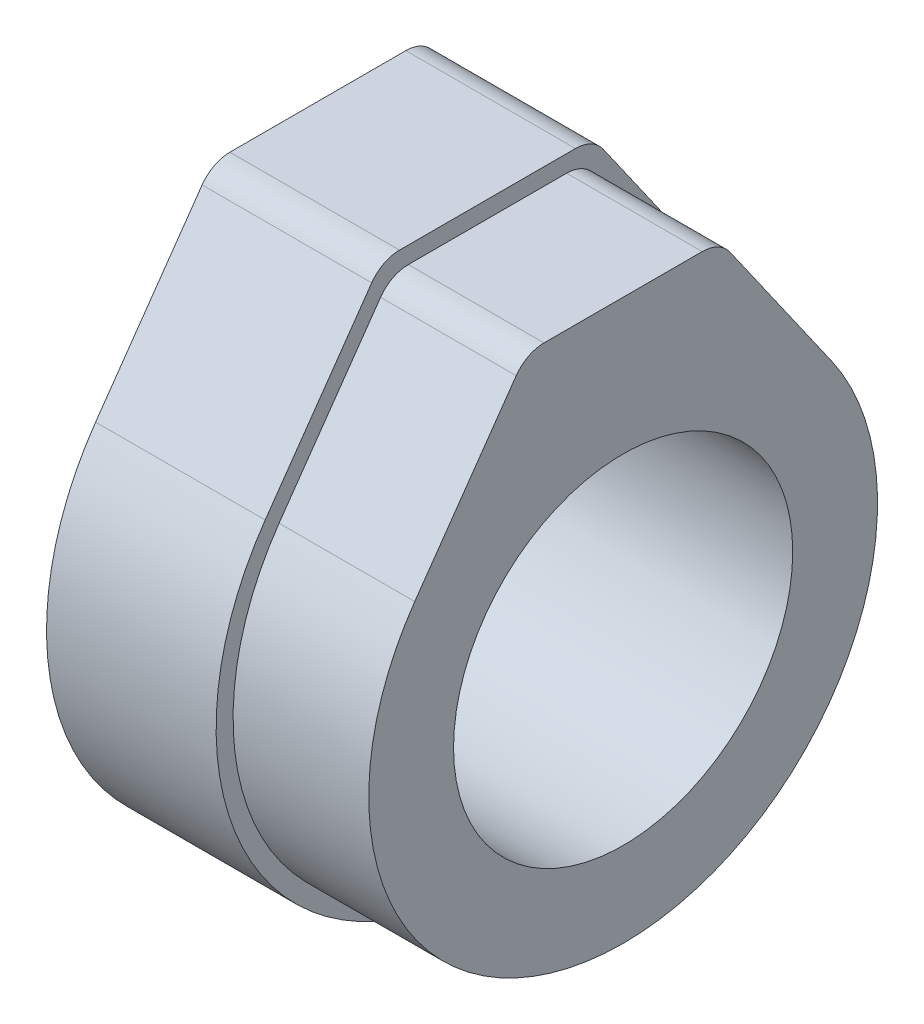
ISO-10303-21;
HEADER;
FILE_DESCRIPTION(('STEP AP214'),'2;1');
FILE_NAME('part.step','',(''),(''),'','','');
FILE_SCHEMA(('AUTOMOTIVE_DESIGN { 1 0 10303 214 1 1 1 1 }'));
ENDSEC;
DATA;
#1=APPLICATION_CONTEXT('core data for automotive mechanical design processes');
#2=APPLICATION_PROTOCOL_DEFINITION('international standard','automotive_design',2000,#1);
#3=PRODUCT_CONTEXT('',#1,'mechanical');
#4=PRODUCT('Part','Part','',(#3));
#5=PRODUCT_RELATED_PRODUCT_CATEGORY('part','',(#4));
#6=PRODUCT_DEFINITION_FORMATION('','',#4);
#7=PRODUCT_DEFINITION_CONTEXT('part definition',#1,'design');
#8=PRODUCT_DEFINITION('design','',#6,#7);
#9=PRODUCT_DEFINITION_SHAPE('','',#8);
#10=(LENGTH_UNIT() NAMED_UNIT(*) SI_UNIT(.MILLI.,.METRE.));
#11=(NAMED_UNIT(*) PLANE_ANGLE_UNIT() SI_UNIT($,.RADIAN.));
#12=(NAMED_UNIT(*) SI_UNIT($,.STERADIAN.) SOLID_ANGLE_UNIT());
#13=UNCERTAINTY_MEASURE_WITH_UNIT(LENGTH_MEASURE(1.E-05),#10,'distance_accuracy_value','');
#14=(GEOMETRIC_REPRESENTATION_CONTEXT(3) GLOBAL_UNCERTAINTY_ASSIGNED_CONTEXT((#13)) GLOBAL_UNIT_ASSIGNED_CONTEXT((#10,
#11,#12)) REPRESENTATION_CONTEXT('',''));
#15=CARTESIAN_POINT('',(0.,0.,0.));
#16=DIRECTION('',(0.,0.,1.));
#17=DIRECTION('',(1.,0.,0.));
#18=AXIS2_PLACEMENT_3D('',#15,#16,#17);
#19=CARTESIAN_POINT('',(10.,19.,0.));
#20=DIRECTION('',(0.,1.,0.));
#21=DIRECTION('',(0.,0.,1.));
#22=AXIS2_PLACEMENT_3D('',#19,#20,#21);
#23=PLANE('',#22);
#24=DIRECTION('',(0.,0.,-1.));
#25=VECTOR('',#24,1.);
#26=CARTESIAN_POINT('',(10.,19.,0.));
#27=LINE('',#26,#25);
#28=CARTESIAN_POINT('',(10.,19.,5.18731609309536));
#29=VERTEX_POINT('',#28);
#30=CARTESIAN_POINT('',(10.,19.,-5.18731609309536));
#31=VERTEX_POINT('',#30);
#32=EDGE_CURVE('E162',#29,#31,#27,.T.);
#33=ORIENTED_EDGE('',*,*,#32,.T.);
#34=DIRECTION('',(-1.,0.,0.));
#35=VECTOR('',#34,1.);
#36=CARTESIAN_POINT('',(10.,19.,-5.18731609309536));
#37=LINE('',#36,#35);
#38=CARTESIAN_POINT('',(0.,19.,-5.18731609309536));
#39=VERTEX_POINT('',#38);
#40=EDGE_CURVE('E199',#31,#39,#37,.T.);
#41=ORIENTED_EDGE('',*,*,#40,.T.);
#42=DIRECTION('',(0.,0.,-1.));
#43=VECTOR('',#42,1.);
#44=CARTESIAN_POINT('',(0.,19.,0.));
#45=LINE('',#44,#43);
#46=CARTESIAN_POINT('',(0.,19.,5.18731609309536));
#47=VERTEX_POINT('',#46);
#48=EDGE_CURVE('E153',#47,#39,#45,.T.);
#49=ORIENTED_EDGE('',*,*,#48,.F.);
#50=DIRECTION('',(-1.,0.,0.));
#51=VECTOR('',#50,1.);
#52=CARTESIAN_POINT('',(10.,19.,5.18731609309536));
#53=LINE('',#52,#51);
#54=EDGE_CURVE('E197',#47,#29,#53,.F.);
#55=ORIENTED_EDGE('',*,*,#54,.T.);
#56=EDGE_LOOP('',(#33,#41,#49,#55));
#57=FACE_BOUND('',#56,.T.);
#58=ADVANCED_FACE('F36',(#57),#23,.T.);
#59=CARTESIAN_POINT('',(10.,9.1772229816167,13.1064327086239));
#60=DIRECTION('',(0.,0.573576436351044,0.819152044288993));
#61=DIRECTION('',(0.,-0.819152044288993,0.573576436351044));
#62=AXIS2_PLACEMENT_3D('',#59,#60,#61);
#63=PLANE('',#62);
#64=DIRECTION('',(0.,0.819152044288993,-0.573576436351044));
#65=VECTOR('',#64,1.);
#66=CARTESIAN_POINT('',(10.,9.1772229816167,13.1064327086239));
#67=LINE('',#66,#65);
#68=CARTESIAN_POINT('',(10.,9.17722298161671,13.1064327086239));
#69=VERTEX_POINT('',#68);
#70=CARTESIAN_POINT('',(10.,18.1471528727021,6.82562018167334));
#71=VERTEX_POINT('',#70);
#72=EDGE_CURVE('E165',#69,#71,#67,.T.);
#73=ORIENTED_EDGE('',*,*,#72,.T.);
#74=DIRECTION('',(-1.,0.,0.));
#75=VECTOR('',#74,1.);
#76=CARTESIAN_POINT('',(10.,18.1471528727021,6.82562018167335));
#77=LINE('',#76,#75);
#78=CARTESIAN_POINT('',(0.,18.1471528727021,6.82562018167334));
#79=VERTEX_POINT('',#78);
#80=EDGE_CURVE('E210',#71,#79,#77,.T.);
#81=ORIENTED_EDGE('',*,*,#80,.T.);
#82=DIRECTION('',(0.,0.819152044288993,-0.573576436351044));
#83=VECTOR('',#82,1.);
#84=CARTESIAN_POINT('',(0.,9.1772229816167,13.1064327086239));
#85=LINE('',#84,#83);
#86=CARTESIAN_POINT('',(0.,9.17722298161671,13.1064327086239));
#87=VERTEX_POINT('',#86);
#88=EDGE_CURVE('E157',#87,#79,#85,.T.);
#89=ORIENTED_EDGE('',*,*,#88,.F.);
#90=DIRECTION('',(-1.,0.,0.));
#91=VECTOR('',#90,1.);
#92=CARTESIAN_POINT('',(10.,9.17722298161671,13.1064327086239));
#93=LINE('',#92,#91);
#94=EDGE_CURVE('E182',#69,#87,#93,.T.);
#95=ORIENTED_EDGE('',*,*,#94,.F.);
#96=EDGE_LOOP('',(#73,#81,#89,#95));
#97=FACE_BOUND('',#96,.T.);
#98=ADVANCED_FACE('F249',(#97),#63,.T.);
#99=CARTESIAN_POINT('',(10.,0.,0.));
#100=DIRECTION('',(-1.,0.,0.));
#101=DIRECTION('',(0.,0.,1.));
#102=AXIS2_PLACEMENT_3D('',#99,#100,#101);
#103=CYLINDRICAL_SURFACE('',#102,16.);
#104=CARTESIAN_POINT('',(0.,0.,0.));
#105=DIRECTION('',(1.,0.,0.));
#106=DIRECTION('',(0.,0.,-1.));
#107=AXIS2_PLACEMENT_3D('',#104,#105,#106);
#108=CIRCLE('',#107,16.);
#109=CARTESIAN_POINT('',(0.,9.17722298161671,-13.1064327086239));
#110=VERTEX_POINT('',#109);
#111=EDGE_CURVE('E176',#87,#110,#108,.T.);
#112=ORIENTED_EDGE('',*,*,#111,.T.);
#113=DIRECTION('',(-1.,0.,0.));
#114=VECTOR('',#113,1.);
#115=CARTESIAN_POINT('',(10.,9.17722298161671,-13.1064327086239));
#116=LINE('',#115,#114);
#117=CARTESIAN_POINT('',(10.,9.17722298161671,-13.1064327086239));
#118=VERTEX_POINT('',#117);
#119=EDGE_CURVE('E172',#118,#110,#116,.T.);
#120=ORIENTED_EDGE('',*,*,#119,.F.);
#121=CARTESIAN_POINT('',(10.,0.,0.));
#122=DIRECTION('',(1.,0.,0.));
#123=DIRECTION('',(0.,0.,-1.));
#124=AXIS2_PLACEMENT_3D('',#121,#122,#123);
#125=CIRCLE('',#124,16.);
#126=EDGE_CURVE('E168',#69,#118,#125,.T.);
#127=ORIENTED_EDGE('',*,*,#126,.F.);
#128=ORIENTED_EDGE('',*,*,#94,.T.);
#129=EDGE_LOOP('',(#112,#120,#127,#128));
#130=FACE_BOUND('',#129,.T.);
#131=ADVANCED_FACE('F255',(#130),#103,.T.);
#132=CARTESIAN_POINT('',(10.,9.1772229816167,-13.1064327086239));
#133=DIRECTION('',(0.,0.573576436351044,-0.819152044288993));
#134=DIRECTION('',(0.,0.819152044288993,0.573576436351044));
#135=AXIS2_PLACEMENT_3D('',#132,#133,#134);
#136=PLANE('',#135);
#137=DIRECTION('',(0.,-0.819152044288993,-0.573576436351044));
#138=VECTOR('',#137,1.);
#139=CARTESIAN_POINT('',(0.,9.1772229816167,-13.1064327086239));
#140=LINE('',#139,#138);
#141=CARTESIAN_POINT('',(0.,18.1471528727021,-6.82562018167334));
#142=VERTEX_POINT('',#141);
#143=EDGE_CURVE('E166',#142,#110,#140,.T.);
#144=ORIENTED_EDGE('',*,*,#143,.F.);
#145=DIRECTION('',(-1.,0.,0.));
#146=VECTOR('',#145,1.);
#147=CARTESIAN_POINT('',(10.,18.1471528727021,-6.82562018167335));
#148=LINE('',#147,#146);
#149=CARTESIAN_POINT('',(10.,18.1471528727021,-6.82562018167334));
#150=VERTEX_POINT('',#149);
#151=EDGE_CURVE('E59',#142,#150,#148,.F.);
#152=ORIENTED_EDGE('',*,*,#151,.T.);
#153=DIRECTION('',(0.,-0.819152044288993,-0.573576436351044));
#154=VECTOR('',#153,1.);
#155=CARTESIAN_POINT('',(10.,9.1772229816167,-13.1064327086239));
#156=LINE('',#155,#154);
#157=EDGE_CURVE('E171',#150,#118,#156,.T.);
#158=ORIENTED_EDGE('',*,*,#157,.T.);
#159=ORIENTED_EDGE('',*,*,#119,.T.);
#160=EDGE_LOOP('',(#144,#152,#158,#159));
#161=FACE_BOUND('',#160,.T.);
#162=ADVANCED_FACE('F261',(#161),#136,.T.);
#163=CARTESIAN_POINT('',(10.,0.,0.));
#164=DIRECTION('',(1.,0.,0.));
#165=DIRECTION('',(0.,0.,-1.));
#166=AXIS2_PLACEMENT_3D('',#163,#164,#165);
#167=PLANE('',#166);
#168=CARTESIAN_POINT('',(10.,0.,0.));
#169=DIRECTION('',(1.,0.,0.));
#170=DIRECTION('',(0.,0.,-1.));
#171=AXIS2_PLACEMENT_3D('',#168,#169,#170);
#172=CIRCLE('',#171,15.);
#173=CARTESIAN_POINT('',(10.,8.60364654526566,12.2872806643349));
#174=VERTEX_POINT('',#173);
#175=CARTESIAN_POINT('',(10.,8.60364654526566,-12.2872806643349));
#176=VERTEX_POINT('',#175);
#177=EDGE_CURVE('E152',#174,#176,#172,.T.);
#178=ORIENTED_EDGE('',*,*,#177,.F.);
#179=DIRECTION('',(0.,0.819152044288993,-0.573576436351044));
#180=VECTOR('',#179,1.);
#181=CARTESIAN_POINT('',(10.,8.60364654526566,12.2872806643349));
#182=LINE('',#181,#180);
#183=CARTESIAN_POINT('',(10.,17.1471528727021,6.3050531311216));
#184=VERTEX_POINT('',#183);
#185=EDGE_CURVE('E147',#174,#184,#182,.T.);
#186=ORIENTED_EDGE('',*,*,#185,.T.);
#187=CARTESIAN_POINT('',(10.,16.,4.66674904254361));
#188=DIRECTION('',(1.,0.,0.));
#189=DIRECTION('',(0.,0.,-1.));
#190=AXIS2_PLACEMENT_3D('',#187,#188,#189);
#191=CIRCLE('',#190,2.);
#192=CARTESIAN_POINT('',(10.,18.,4.66674904254361));
#193=VERTEX_POINT('',#192);
#194=EDGE_CURVE('E44',#184,#193,#191,.F.);
#195=ORIENTED_EDGE('',*,*,#194,.T.);
#196=DIRECTION('',(0.,0.,-1.));
#197=VECTOR('',#196,1.);
#198=CARTESIAN_POINT('',(10.,18.,5.70788314364711));
#199=LINE('',#198,#197);
#200=CARTESIAN_POINT('',(10.,18.,-4.66674904254361));
#201=VERTEX_POINT('',#200);
#202=EDGE_CURVE('E217',#193,#201,#199,.T.);
#203=ORIENTED_EDGE('',*,*,#202,.T.);
#204=CARTESIAN_POINT('',(10.,16.,-4.66674904254361));
#205=DIRECTION('',(1.,0.,0.));
#206=DIRECTION('',(0.,0.,-1.));
#207=AXIS2_PLACEMENT_3D('',#204,#205,#206);
#208=CIRCLE('',#207,2.);
#209=CARTESIAN_POINT('',(10.,17.1471528727021,-6.3050531311216));
#210=VERTEX_POINT('',#209);
#211=EDGE_CURVE('E11',#201,#210,#208,.F.);
#212=ORIENTED_EDGE('',*,*,#211,.T.);
#213=DIRECTION('',(0.,-0.819152044288993,-0.573576436351044));
#214=VECTOR('',#213,1.);
#215=CARTESIAN_POINT('',(10.,18.,-5.70788314364711));
#216=LINE('',#215,#214);
#217=EDGE_CURVE('E226',#210,#176,#216,.T.);
#218=ORIENTED_EDGE('',*,*,#217,.T.);
#219=EDGE_LOOP('',(#178,#186,#195,#203,#212,#218));
#220=FACE_BOUND('',#219,.T.);
#221=ORIENTED_EDGE('',*,*,#157,.F.);
#222=CARTESIAN_POINT('',(10.,17.,-5.18731609309536));
#223=DIRECTION('',(1.,0.,0.));
#224=DIRECTION('',(0.,0.,-1.));
#225=AXIS2_PLACEMENT_3D('',#222,#223,#224);
#226=CIRCLE('',#225,2.);
#227=EDGE_CURVE('E208',#150,#31,#226,.T.);
#228=ORIENTED_EDGE('',*,*,#227,.T.);
#229=ORIENTED_EDGE('',*,*,#32,.F.);
#230=CARTESIAN_POINT('',(10.,17.,5.18731609309536));
#231=DIRECTION('',(1.,0.,0.));
#232=DIRECTION('',(0.,0.,-1.));
#233=AXIS2_PLACEMENT_3D('',#230,#231,#232);
#234=CIRCLE('',#233,2.);
#235=EDGE_CURVE('E51',#29,#71,#234,.T.);
#236=ORIENTED_EDGE('',*,*,#235,.T.);
#237=ORIENTED_EDGE('',*,*,#72,.F.);
#238=ORIENTED_EDGE('',*,*,#126,.T.);
#239=EDGE_LOOP('',(#221,#228,#229,#236,#237,#238));
#240=FACE_BOUND('',#239,.T.);
#241=ADVANCED_FACE('F216',(#220,#240),#167,.T.);
#242=CARTESIAN_POINT('',(0.,0.,0.));
#243=DIRECTION('',(1.,0.,0.));
#244=DIRECTION('',(0.,0.,-1.));
#245=AXIS2_PLACEMENT_3D('',#242,#243,#244);
#246=PLANE('',#245);
#247=CARTESIAN_POINT('',(0.,0.,0.));
#248=DIRECTION('',(1.,0.,0.));
#249=DIRECTION('',(0.,0.,-1.));
#250=AXIS2_PLACEMENT_3D('',#247,#248,#249);
#251=CIRCLE('',#250,10.);
#252=CARTESIAN_POINT('',(0.,0.,-10.));
#253=VERTEX_POINT('',#252);
#254=EDGE_CURVE('E236',#253,#253,#251,.F.);
#255=ORIENTED_EDGE('',*,*,#254,.F.);
#256=EDGE_LOOP('',(#255));
#257=FACE_BOUND('',#256,.T.);
#258=ORIENTED_EDGE('',*,*,#48,.T.);
#259=CARTESIAN_POINT('',(0.,17.,-5.18731609309536));
#260=DIRECTION('',(1.,0.,0.));
#261=DIRECTION('',(0.,0.,-1.));
#262=AXIS2_PLACEMENT_3D('',#259,#260,#261);
#263=CIRCLE('',#262,2.);
#264=EDGE_CURVE('E204',#39,#142,#263,.F.);
#265=ORIENTED_EDGE('',*,*,#264,.T.);
#266=ORIENTED_EDGE('',*,*,#143,.T.);
#267=ORIENTED_EDGE('',*,*,#111,.F.);
#268=ORIENTED_EDGE('',*,*,#88,.T.);
#269=CARTESIAN_POINT('',(0.,17.,5.18731609309536));
#270=DIRECTION('',(1.,0.,0.));
#271=DIRECTION('',(0.,0.,-1.));
#272=AXIS2_PLACEMENT_3D('',#269,#270,#271);
#273=CIRCLE('',#272,2.);
#274=EDGE_CURVE('E202',#79,#47,#273,.F.);
#275=ORIENTED_EDGE('',*,*,#274,.T.);
#276=EDGE_LOOP('',(#258,#265,#266,#267,#268,#275));
#277=FACE_BOUND('',#276,.T.);
#278=ADVANCED_FACE('F265',(#257,#277),#246,.F.);
#279=CARTESIAN_POINT('',(18.,0.,0.));
#280=DIRECTION('',(-1.,0.,0.));
#281=DIRECTION('',(0.,0.,1.));
#282=AXIS2_PLACEMENT_3D('',#279,#280,#281);
#283=CYLINDRICAL_SURFACE('',#282,15.);
#284=ORIENTED_EDGE('',*,*,#177,.T.);
#285=DIRECTION('',(-1.,0.,0.));
#286=VECTOR('',#285,1.);
#287=CARTESIAN_POINT('',(18.,8.60364654526566,-12.2872806643349));
#288=LINE('',#287,#286);
#289=CARTESIAN_POINT('',(18.,8.60364654526566,-12.2872806643349));
#290=VERTEX_POINT('',#289);
#291=EDGE_CURVE('E132',#290,#176,#288,.T.);
#292=ORIENTED_EDGE('',*,*,#291,.F.);
#293=CARTESIAN_POINT('',(18.,0.,0.));
#294=DIRECTION('',(1.,0.,0.));
#295=DIRECTION('',(0.,0.,-1.));
#296=AXIS2_PLACEMENT_3D('',#293,#294,#295);
#297=CIRCLE('',#296,15.);
#298=CARTESIAN_POINT('',(18.,8.60364654526566,12.2872806643349));
#299=VERTEX_POINT('',#298);
#300=EDGE_CURVE('E138',#299,#290,#297,.T.);
#301=ORIENTED_EDGE('',*,*,#300,.F.);
#302=DIRECTION('',(-1.,0.,0.));
#303=VECTOR('',#302,1.);
#304=CARTESIAN_POINT('',(18.,8.60364654526566,12.2872806643349));
#305=LINE('',#304,#303);
#306=EDGE_CURVE('E154',#299,#174,#305,.T.);
#307=ORIENTED_EDGE('',*,*,#306,.T.);
#308=EDGE_LOOP('',(#284,#292,#301,#307));
#309=FACE_BOUND('',#308,.T.);
#310=ADVANCED_FACE('F150',(#309),#283,.T.);
#311=CARTESIAN_POINT('',(18.,18.,-5.70788314364711));
#312=DIRECTION('',(0.,0.573576436351044,-0.819152044288993));
#313=DIRECTION('',(0.,0.819152044288993,0.573576436351044));
#314=AXIS2_PLACEMENT_3D('',#311,#312,#313);
#315=PLANE('',#314);
#316=ORIENTED_EDGE('',*,*,#217,.F.);
#317=DIRECTION('',(-1.,0.,0.));
#318=VECTOR('',#317,1.);
#319=CARTESIAN_POINT('',(18.,17.1471528727021,-6.3050531311216));
#320=LINE('',#319,#318);
#321=CARTESIAN_POINT('',(18.,17.1471528727021,-6.3050531311216));
#322=VERTEX_POINT('',#321);
#323=EDGE_CURVE('E134',#210,#322,#320,.F.);
#324=ORIENTED_EDGE('',*,*,#323,.T.);
#325=DIRECTION('',(0.,-0.819152044288993,-0.573576436351044));
#326=VECTOR('',#325,1.);
#327=CARTESIAN_POINT('',(18.,18.,-5.70788314364711));
#328=LINE('',#327,#326);
#329=EDGE_CURVE('E127',#322,#290,#328,.T.);
#330=ORIENTED_EDGE('',*,*,#329,.T.);
#331=ORIENTED_EDGE('',*,*,#291,.T.);
#332=EDGE_LOOP('',(#316,#324,#330,#331));
#333=FACE_BOUND('',#332,.T.);
#334=ADVANCED_FACE('F130',(#333),#315,.T.);
#335=CARTESIAN_POINT('',(18.,18.,5.70788314364711));
#336=DIRECTION('',(0.,1.,0.));
#337=DIRECTION('',(0.,0.,1.));
#338=AXIS2_PLACEMENT_3D('',#335,#336,#337);
#339=PLANE('',#338);
#340=ORIENTED_EDGE('',*,*,#202,.F.);
#341=DIRECTION('',(-1.,0.,0.));
#342=VECTOR('',#341,1.);
#343=CARTESIAN_POINT('',(18.,18.,4.66674904254361));
#344=LINE('',#343,#342);
#345=CARTESIAN_POINT('',(18.,18.,4.66674904254361));
#346=VERTEX_POINT('',#345);
#347=EDGE_CURVE('E190',#193,#346,#344,.F.);
#348=ORIENTED_EDGE('',*,*,#347,.T.);
#349=DIRECTION('',(0.,0.,-1.));
#350=VECTOR('',#349,1.);
#351=CARTESIAN_POINT('',(18.,18.,5.70788314364711));
#352=LINE('',#351,#350);
#353=CARTESIAN_POINT('',(18.,18.,-4.66674904254361));
#354=VERTEX_POINT('',#353);
#355=EDGE_CURVE('E137',#346,#354,#352,.T.);
#356=ORIENTED_EDGE('',*,*,#355,.T.);
#357=DIRECTION('',(-1.,0.,0.));
#358=VECTOR('',#357,1.);
#359=CARTESIAN_POINT('',(18.,18.,-4.66674904254361));
#360=LINE('',#359,#358);
#361=EDGE_CURVE('E187',#354,#201,#360,.T.);
#362=ORIENTED_EDGE('',*,*,#361,.T.);
#363=EDGE_LOOP('',(#340,#348,#356,#362));
#364=FACE_BOUND('',#363,.T.);
#365=ADVANCED_FACE('F223',(#364),#339,.T.);
#366=CARTESIAN_POINT('',(18.,8.60364654526566,12.2872806643349));
#367=DIRECTION('',(0.,0.573576436351044,0.819152044288993));
#368=DIRECTION('',(0.,-0.819152044288993,0.573576436351044));
#369=AXIS2_PLACEMENT_3D('',#366,#367,#368);
#370=PLANE('',#369);
#371=DIRECTION('',(0.,0.819152044288993,-0.573576436351044));
#372=VECTOR('',#371,1.);
#373=CARTESIAN_POINT('',(18.,8.60364654526566,12.2872806643349));
#374=LINE('',#373,#372);
#375=CARTESIAN_POINT('',(18.,17.1471528727021,6.3050531311216));
#376=VERTEX_POINT('',#375);
#377=EDGE_CURVE('E145',#299,#376,#374,.T.);
#378=ORIENTED_EDGE('',*,*,#377,.T.);
#379=DIRECTION('',(-1.,0.,0.));
#380=VECTOR('',#379,1.);
#381=CARTESIAN_POINT('',(18.,17.1471528727021,6.3050531311216));
#382=LINE('',#381,#380);
#383=EDGE_CURVE('E184',#376,#184,#382,.T.);
#384=ORIENTED_EDGE('',*,*,#383,.T.);
#385=ORIENTED_EDGE('',*,*,#185,.F.);
#386=ORIENTED_EDGE('',*,*,#306,.F.);
#387=EDGE_LOOP('',(#378,#384,#385,#386));
#388=FACE_BOUND('',#387,.T.);
#389=ADVANCED_FACE('F231',(#388),#370,.T.);
#390=CARTESIAN_POINT('',(18.,0.,0.));
#391=DIRECTION('',(1.,0.,0.));
#392=DIRECTION('',(0.,0.,-1.));
#393=AXIS2_PLACEMENT_3D('',#390,#391,#392);
#394=PLANE('',#393);
#395=CARTESIAN_POINT('',(18.,0.,0.));
#396=DIRECTION('',(1.,0.,0.));
#397=DIRECTION('',(0.,0.,-1.));
#398=AXIS2_PLACEMENT_3D('',#395,#396,#397);
#399=CIRCLE('',#398,10.);
#400=CARTESIAN_POINT('',(18.,0.,-10.));
#401=VERTEX_POINT('',#400);
#402=EDGE_CURVE('E292',#401,#401,#399,.T.);
#403=ORIENTED_EDGE('',*,*,#402,.F.);
#404=EDGE_LOOP('',(#403));
#405=FACE_BOUND('',#404,.T.);
#406=ORIENTED_EDGE('',*,*,#355,.F.);
#407=CARTESIAN_POINT('',(18.,16.,4.66674904254361));
#408=DIRECTION('',(1.,0.,0.));
#409=DIRECTION('',(0.,0.,-1.));
#410=AXIS2_PLACEMENT_3D('',#407,#408,#409);
#411=CIRCLE('',#410,2.);
#412=EDGE_CURVE('E194',#346,#376,#411,.T.);
#413=ORIENTED_EDGE('',*,*,#412,.T.);
#414=ORIENTED_EDGE('',*,*,#377,.F.);
#415=ORIENTED_EDGE('',*,*,#300,.T.);
#416=ORIENTED_EDGE('',*,*,#329,.F.);
#417=CARTESIAN_POINT('',(18.,16.,-4.66674904254361));
#418=DIRECTION('',(1.,0.,0.));
#419=DIRECTION('',(0.,0.,-1.));
#420=AXIS2_PLACEMENT_3D('',#417,#418,#419);
#421=CIRCLE('',#420,2.);
#422=EDGE_CURVE('E192',#322,#354,#421,.T.);
#423=ORIENTED_EDGE('',*,*,#422,.T.);
#424=EDGE_LOOP('',(#406,#413,#414,#415,#416,#423));
#425=FACE_BOUND('',#424,.T.);
#426=ADVANCED_FACE('F143',(#405,#425),#394,.T.);
#427=CARTESIAN_POINT('',(18.,16.,4.66674904254361));
#428=DIRECTION('',(-1.,0.,0.));
#429=DIRECTION('',(0.,0.,1.));
#430=AXIS2_PLACEMENT_3D('',#427,#428,#429);
#431=CYLINDRICAL_SURFACE('',#430,2.);
#432=ORIENTED_EDGE('',*,*,#412,.F.);
#433=ORIENTED_EDGE('',*,*,#347,.F.);
#434=ORIENTED_EDGE('',*,*,#194,.F.);
#435=ORIENTED_EDGE('',*,*,#383,.F.);
#436=EDGE_LOOP('',(#432,#433,#434,#435));
#437=FACE_BOUND('',#436,.T.);
#438=ADVANCED_FACE('F229',(#437),#431,.T.);
#439=CARTESIAN_POINT('',(18.,16.,-4.66674904254361));
#440=DIRECTION('',(-1.,0.,0.));
#441=DIRECTION('',(0.,0.,1.));
#442=AXIS2_PLACEMENT_3D('',#439,#440,#441);
#443=CYLINDRICAL_SURFACE('',#442,2.);
#444=ORIENTED_EDGE('',*,*,#422,.F.);
#445=ORIENTED_EDGE('',*,*,#323,.F.);
#446=ORIENTED_EDGE('',*,*,#211,.F.);
#447=ORIENTED_EDGE('',*,*,#361,.F.);
#448=EDGE_LOOP('',(#444,#445,#446,#447));
#449=FACE_BOUND('',#448,.T.);
#450=ADVANCED_FACE('F238',(#449),#443,.T.);
#451=CARTESIAN_POINT('',(10.,17.,-5.18731609309536));
#452=DIRECTION('',(-1.,0.,0.));
#453=DIRECTION('',(0.,0.,1.));
#454=AXIS2_PLACEMENT_3D('',#451,#452,#453);
#455=CYLINDRICAL_SURFACE('',#454,2.);
#456=ORIENTED_EDGE('',*,*,#227,.F.);
#457=ORIENTED_EDGE('',*,*,#151,.F.);
#458=ORIENTED_EDGE('',*,*,#264,.F.);
#459=ORIENTED_EDGE('',*,*,#40,.F.);
#460=EDGE_LOOP('',(#456,#457,#458,#459));
#461=FACE_BOUND('',#460,.T.);
#462=ADVANCED_FACE('F240',(#461),#455,.T.);
#463=CARTESIAN_POINT('',(10.,17.,5.18731609309536));
#464=DIRECTION('',(-1.,0.,0.));
#465=DIRECTION('',(0.,0.,1.));
#466=AXIS2_PLACEMENT_3D('',#463,#464,#465);
#467=CYLINDRICAL_SURFACE('',#466,2.);
#468=ORIENTED_EDGE('',*,*,#235,.F.);
#469=ORIENTED_EDGE('',*,*,#54,.F.);
#470=ORIENTED_EDGE('',*,*,#274,.F.);
#471=ORIENTED_EDGE('',*,*,#80,.F.);
#472=EDGE_LOOP('',(#468,#469,#470,#471));
#473=FACE_BOUND('',#472,.T.);
#474=ADVANCED_FACE('F38',(#473),#467,.T.);
#475=CARTESIAN_POINT('',(-0.001000000000001,0.,0.));
#476=DIRECTION('',(1.,0.,0.));
#477=DIRECTION('',(0.,0.,-1.));
#478=AXIS2_PLACEMENT_3D('',#475,#476,#477);
#479=CYLINDRICAL_SURFACE('',#478,10.);
#480=ORIENTED_EDGE('',*,*,#402,.T.);
#481=EDGE_LOOP('',(#480));
#482=FACE_BOUND('',#481,.T.);
#483=ORIENTED_EDGE('',*,*,#254,.T.);
#484=EDGE_LOOP('',(#483));
#485=FACE_BOUND('',#484,.T.);
#486=ADVANCED_FACE('F282',(#482,#485),#479,.F.);
#487=CLOSED_SHELL('',(#58,#98,#131,#162,#241,#278,#310,#334,#365,#389,#426,#438,#450,#462,#474,#486));
#488=MANIFOLD_SOLID_BREP('B2',#487);
#489=ADVANCED_BREP_SHAPE_REPRESENTATION('',(#18,#488),#14);
#490=SHAPE_DEFINITION_REPRESENTATION(#9,#489);
ENDSEC;
END-ISO-10303-21;
